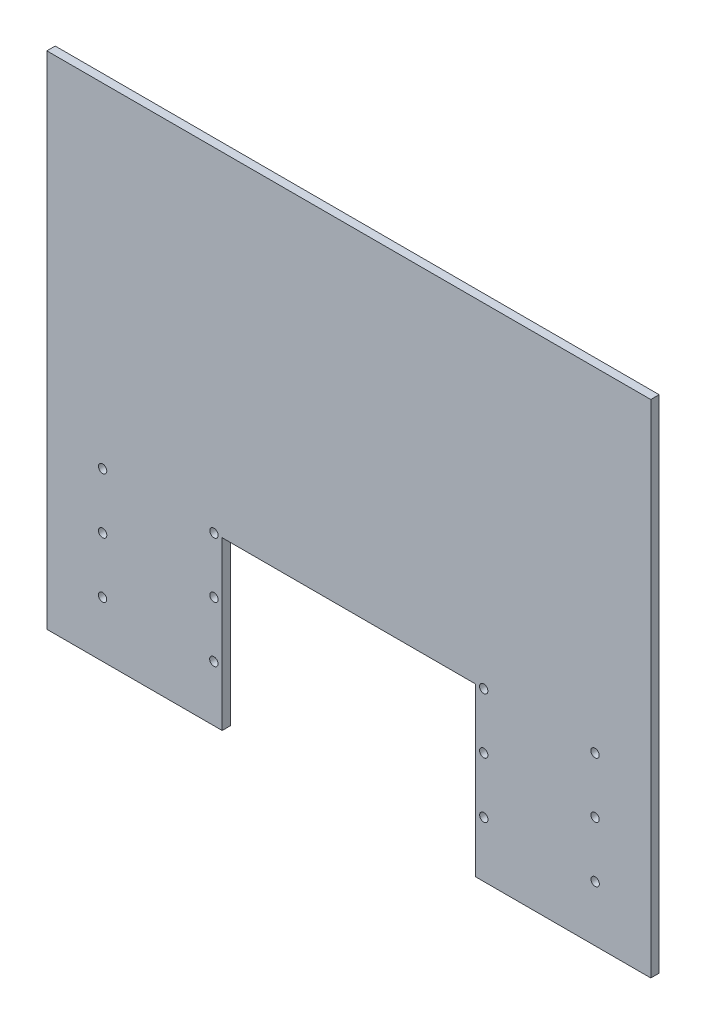
ISO-10303-21;
HEADER;
FILE_DESCRIPTION(('STEP AP214'),'2;1');
FILE_NAME('part.step','',(''),(''),'','','');
FILE_SCHEMA(('AUTOMOTIVE_DESIGN { 1 0 10303 214 1 1 1 1 }'));
ENDSEC;
DATA;
#1=APPLICATION_CONTEXT('core data for automotive mechanical design processes');
#2=APPLICATION_PROTOCOL_DEFINITION('international standard','automotive_design',2000,#1);
#3=PRODUCT_CONTEXT('',#1,'mechanical');
#4=PRODUCT('Part','Part','',(#3));
#5=PRODUCT_RELATED_PRODUCT_CATEGORY('part','',(#4));
#6=PRODUCT_DEFINITION_FORMATION('','',#4);
#7=PRODUCT_DEFINITION_CONTEXT('part definition',#1,'design');
#8=PRODUCT_DEFINITION('design','',#6,#7);
#9=PRODUCT_DEFINITION_SHAPE('','',#8);
#10=(LENGTH_UNIT() NAMED_UNIT(*) SI_UNIT(.MILLI.,.METRE.));
#11=(NAMED_UNIT(*) PLANE_ANGLE_UNIT() SI_UNIT($,.RADIAN.));
#12=(NAMED_UNIT(*) SI_UNIT($,.STERADIAN.) SOLID_ANGLE_UNIT());
#13=UNCERTAINTY_MEASURE_WITH_UNIT(LENGTH_MEASURE(1.E-05),#10,'distance_accuracy_value','');
#14=(GEOMETRIC_REPRESENTATION_CONTEXT(3) GLOBAL_UNCERTAINTY_ASSIGNED_CONTEXT((#13)) GLOBAL_UNIT_ASSIGNED_CONTEXT((#10,
#11,#12)) REPRESENTATION_CONTEXT('',''));
#15=CARTESIAN_POINT('',(0.,0.,0.));
#16=DIRECTION('',(0.,0.,1.));
#17=DIRECTION('',(1.,0.,0.));
#18=AXIS2_PLACEMENT_3D('',#15,#16,#17);
#19=CARTESIAN_POINT('',(0.,-52.4301503937767,1.5));
#20=DIRECTION('',(0.,1.,0.));
#21=DIRECTION('',(-1.,0.,0.));
#22=AXIS2_PLACEMENT_3D('',#19,#20,#21);
#23=PLANE('',#22);
#24=DIRECTION('',(1.,0.,0.));
#25=VECTOR('',#24,1.);
#26=CARTESIAN_POINT('',(0.,-52.4301503937767,0.));
#27=LINE('',#26,#25);
#28=CARTESIAN_POINT('',(-54.4329643296433,-52.4301503937767,0.));
#29=VERTEX_POINT('',#28);
#30=CARTESIAN_POINT('',(-22.9329643296433,-52.4301503937767,0.));
#31=VERTEX_POINT('',#30);
#32=EDGE_CURVE('E166',#29,#31,#27,.T.);
#33=ORIENTED_EDGE('',*,*,#32,.T.);
#34=DIRECTION('',(0.,0.,-1.));
#35=VECTOR('',#34,1.);
#36=CARTESIAN_POINT('',(-22.9329643296433,-52.4301503937767,1.5));
#37=LINE('',#36,#35);
#38=CARTESIAN_POINT('',(-22.9329643296433,-52.4301503937767,1.5));
#39=VERTEX_POINT('',#38);
#40=EDGE_CURVE('E11',#39,#31,#37,.T.);
#41=ORIENTED_EDGE('',*,*,#40,.F.);
#42=DIRECTION('',(1.,0.,0.));
#43=VECTOR('',#42,1.);
#44=CARTESIAN_POINT('',(0.,-52.4301503937767,1.5));
#45=LINE('',#44,#43);
#46=CARTESIAN_POINT('',(-54.4329643296433,-52.4301503937767,1.5));
#47=VERTEX_POINT('',#46);
#48=EDGE_CURVE('E221',#47,#39,#45,.T.);
#49=ORIENTED_EDGE('',*,*,#48,.F.);
#50=DIRECTION('',(0.,0.,-1.));
#51=VECTOR('',#50,1.);
#52=CARTESIAN_POINT('',(-54.4329643296433,-52.4301503937767,1.5));
#53=LINE('',#52,#51);
#54=EDGE_CURVE('E165',#47,#29,#53,.T.);
#55=ORIENTED_EDGE('',*,*,#54,.T.);
#56=EDGE_LOOP('',(#33,#41,#49,#55));
#57=FACE_BOUND('',#56,.T.);
#58=ADVANCED_FACE('F34',(#57),#23,.F.);
#59=CARTESIAN_POINT('',(-22.9329643296433,0.,1.5));
#60=DIRECTION('',(-1.,0.,0.));
#61=DIRECTION('',(0.,0.,1.));
#62=AXIS2_PLACEMENT_3D('',#59,#60,#61);
#63=PLANE('',#62);
#64=DIRECTION('',(0.,1.,0.));
#65=VECTOR('',#64,1.);
#66=CARTESIAN_POINT('',(-22.9329643296433,0.,0.));
#67=LINE('',#66,#65);
#68=CARTESIAN_POINT('',(-22.9329643296433,-22.4301503937767,0.));
#69=VERTEX_POINT('',#68);
#70=EDGE_CURVE('E169',#31,#69,#67,.T.);
#71=ORIENTED_EDGE('',*,*,#70,.T.);
#72=DIRECTION('',(0.,0.,-1.));
#73=VECTOR('',#72,1.);
#74=CARTESIAN_POINT('',(-22.9329643296433,-22.4301503937767,1.5));
#75=LINE('',#74,#73);
#76=CARTESIAN_POINT('',(-22.9329643296433,-22.4301503937767,1.5));
#77=VERTEX_POINT('',#76);
#78=EDGE_CURVE('E42',#77,#69,#75,.T.);
#79=ORIENTED_EDGE('',*,*,#78,.F.);
#80=DIRECTION('',(0.,1.,0.));
#81=VECTOR('',#80,1.);
#82=CARTESIAN_POINT('',(-22.9329643296433,0.,1.5));
#83=LINE('',#82,#81);
#84=EDGE_CURVE('E89',#39,#77,#83,.T.);
#85=ORIENTED_EDGE('',*,*,#84,.F.);
#86=ORIENTED_EDGE('',*,*,#40,.T.);
#87=EDGE_LOOP('',(#71,#79,#85,#86));
#88=FACE_BOUND('',#87,.T.);
#89=ADVANCED_FACE('F234',(#88),#63,.F.);
#90=CARTESIAN_POINT('',(0.,-22.4301503937767,1.5));
#91=DIRECTION('',(0.,-1.,0.));
#92=DIRECTION('',(1.,0.,0.));
#93=AXIS2_PLACEMENT_3D('',#90,#91,#92);
#94=PLANE('',#93);
#95=DIRECTION('',(-1.,0.,0.));
#96=VECTOR('',#95,1.);
#97=CARTESIAN_POINT('',(0.,-22.4301503937767,0.));
#98=LINE('',#97,#96);
#99=CARTESIAN_POINT('',(22.5670356703567,-22.4301503937767,0.));
#100=VERTEX_POINT('',#99);
#101=EDGE_CURVE('E172',#100,#69,#98,.T.);
#102=ORIENTED_EDGE('',*,*,#101,.F.);
#103=DIRECTION('',(0.,0.,-1.));
#104=VECTOR('',#103,1.);
#105=CARTESIAN_POINT('',(22.5670356703567,-22.4301503937767,1.5));
#106=LINE('',#105,#104);
#107=CARTESIAN_POINT('',(22.5670356703567,-22.4301503937767,1.5));
#108=VERTEX_POINT('',#107);
#109=EDGE_CURVE('E227',#108,#100,#106,.T.);
#110=ORIENTED_EDGE('',*,*,#109,.F.);
#111=DIRECTION('',(-1.,0.,0.));
#112=VECTOR('',#111,1.);
#113=CARTESIAN_POINT('',(0.,-22.4301503937767,1.5));
#114=LINE('',#113,#112);
#115=EDGE_CURVE('E233',#108,#77,#114,.T.);
#116=ORIENTED_EDGE('',*,*,#115,.T.);
#117=ORIENTED_EDGE('',*,*,#78,.T.);
#118=EDGE_LOOP('',(#102,#110,#116,#117));
#119=FACE_BOUND('',#118,.T.);
#120=ADVANCED_FACE('F231',(#119),#94,.T.);
#121=CARTESIAN_POINT('',(22.5670356703567,0.,1.5));
#122=DIRECTION('',(-1.,0.,0.));
#123=DIRECTION('',(0.,-1.,0.));
#124=AXIS2_PLACEMENT_3D('',#121,#122,#123);
#125=PLANE('',#124);
#126=DIRECTION('',(0.,1.,0.));
#127=VECTOR('',#126,1.);
#128=CARTESIAN_POINT('',(22.5670356703567,0.,0.));
#129=LINE('',#128,#127);
#130=CARTESIAN_POINT('',(22.5670356703567,-52.4301503937767,0.));
#131=VERTEX_POINT('',#130);
#132=EDGE_CURVE('E175',#131,#100,#129,.T.);
#133=ORIENTED_EDGE('',*,*,#132,.F.);
#134=DIRECTION('',(0.,0.,-1.));
#135=VECTOR('',#134,1.);
#136=CARTESIAN_POINT('',(22.5670356703567,-52.4301503937767,1.5));
#137=LINE('',#136,#135);
#138=CARTESIAN_POINT('',(22.5670356703567,-52.4301503937767,1.5));
#139=VERTEX_POINT('',#138);
#140=EDGE_CURVE('E225',#139,#131,#137,.T.);
#141=ORIENTED_EDGE('',*,*,#140,.F.);
#142=DIRECTION('',(0.,1.,0.));
#143=VECTOR('',#142,1.);
#144=CARTESIAN_POINT('',(22.5670356703567,0.,1.5));
#145=LINE('',#144,#143);
#146=EDGE_CURVE('E245',#139,#108,#145,.T.);
#147=ORIENTED_EDGE('',*,*,#146,.T.);
#148=ORIENTED_EDGE('',*,*,#109,.T.);
#149=EDGE_LOOP('',(#133,#141,#147,#148));
#150=FACE_BOUND('',#149,.T.);
#151=ADVANCED_FACE('F243',(#150),#125,.T.);
#152=CARTESIAN_POINT('',(0.,-52.4301503937767,1.5));
#153=DIRECTION('',(0.,-1.,0.));
#154=DIRECTION('',(1.,0.,0.));
#155=AXIS2_PLACEMENT_3D('',#152,#153,#154);
#156=PLANE('',#155);
#157=DIRECTION('',(-1.,0.,0.));
#158=VECTOR('',#157,1.);
#159=CARTESIAN_POINT('',(0.,-52.4301503937767,0.));
#160=LINE('',#159,#158);
#161=CARTESIAN_POINT('',(54.0670356703567,-52.4301503937767,0.));
#162=VERTEX_POINT('',#161);
#163=EDGE_CURVE('E178',#162,#131,#160,.T.);
#164=ORIENTED_EDGE('',*,*,#163,.F.);
#165=DIRECTION('',(0.,0.,-1.));
#166=VECTOR('',#165,1.);
#167=CARTESIAN_POINT('',(54.0670356703567,-52.4301503937767,1.5));
#168=LINE('',#167,#166);
#169=CARTESIAN_POINT('',(54.0670356703567,-52.4301503937767,1.5));
#170=VERTEX_POINT('',#169);
#171=EDGE_CURVE('E114',#170,#162,#168,.T.);
#172=ORIENTED_EDGE('',*,*,#171,.F.);
#173=DIRECTION('',(-1.,0.,0.));
#174=VECTOR('',#173,1.);
#175=CARTESIAN_POINT('',(0.,-52.4301503937767,1.5));
#176=LINE('',#175,#174);
#177=EDGE_CURVE('E122',#170,#139,#176,.T.);
#178=ORIENTED_EDGE('',*,*,#177,.T.);
#179=ORIENTED_EDGE('',*,*,#140,.T.);
#180=EDGE_LOOP('',(#164,#172,#178,#179));
#181=FACE_BOUND('',#180,.T.);
#182=ADVANCED_FACE('F251',(#181),#156,.T.);
#183=CARTESIAN_POINT('',(54.0670356703567,0.,1.5));
#184=DIRECTION('',(1.,0.,0.));
#185=DIRECTION('',(0.,1.,0.));
#186=AXIS2_PLACEMENT_3D('',#183,#184,#185);
#187=PLANE('',#186);
#188=DIRECTION('',(0.,-1.,0.));
#189=VECTOR('',#188,1.);
#190=CARTESIAN_POINT('',(54.0670356703567,0.,0.));
#191=LINE('',#190,#189);
#192=CARTESIAN_POINT('',(54.0670356703567,37.5698496062233,0.));
#193=VERTEX_POINT('',#192);
#194=EDGE_CURVE('E109',#193,#162,#191,.T.);
#195=ORIENTED_EDGE('',*,*,#194,.F.);
#196=DIRECTION('',(0.,0.,-1.));
#197=VECTOR('',#196,1.);
#198=CARTESIAN_POINT('',(54.0670356703567,37.5698496062233,1.5));
#199=LINE('',#198,#197);
#200=CARTESIAN_POINT('',(54.0670356703567,37.5698496062233,1.5));
#201=VERTEX_POINT('',#200);
#202=EDGE_CURVE('E104',#201,#193,#199,.T.);
#203=ORIENTED_EDGE('',*,*,#202,.F.);
#204=DIRECTION('',(0.,-1.,0.));
#205=VECTOR('',#204,1.);
#206=CARTESIAN_POINT('',(54.0670356703567,0.,1.5));
#207=LINE('',#206,#205);
#208=EDGE_CURVE('E107',#201,#170,#207,.T.);
#209=ORIENTED_EDGE('',*,*,#208,.T.);
#210=ORIENTED_EDGE('',*,*,#171,.T.);
#211=EDGE_LOOP('',(#195,#203,#209,#210));
#212=FACE_BOUND('',#211,.T.);
#213=ADVANCED_FACE('F106',(#212),#187,.T.);
#214=CARTESIAN_POINT('',(0.,37.5698496062233,1.5));
#215=DIRECTION('',(0.,1.,0.));
#216=DIRECTION('',(-1.,0.,0.));
#217=AXIS2_PLACEMENT_3D('',#214,#215,#216);
#218=PLANE('',#217);
#219=DIRECTION('',(1.,0.,0.));
#220=VECTOR('',#219,1.);
#221=CARTESIAN_POINT('',(0.,37.5698496062233,0.));
#222=LINE('',#221,#220);
#223=CARTESIAN_POINT('',(-54.4329643296433,37.5698496062233,0.));
#224=VERTEX_POINT('',#223);
#225=EDGE_CURVE('E182',#224,#193,#222,.T.);
#226=ORIENTED_EDGE('',*,*,#225,.F.);
#227=DIRECTION('',(0.,0.,-1.));
#228=VECTOR('',#227,1.);
#229=CARTESIAN_POINT('',(-54.4329643296433,37.5698496062233,1.5));
#230=LINE('',#229,#228);
#231=CARTESIAN_POINT('',(-54.4329643296433,37.5698496062233,1.5));
#232=VERTEX_POINT('',#231);
#233=EDGE_CURVE('E78',#232,#224,#230,.T.);
#234=ORIENTED_EDGE('',*,*,#233,.F.);
#235=DIRECTION('',(1.,0.,0.));
#236=VECTOR('',#235,1.);
#237=CARTESIAN_POINT('',(0.,37.5698496062233,1.5));
#238=LINE('',#237,#236);
#239=EDGE_CURVE('E119',#232,#201,#238,.T.);
#240=ORIENTED_EDGE('',*,*,#239,.T.);
#241=ORIENTED_EDGE('',*,*,#202,.T.);
#242=EDGE_LOOP('',(#226,#234,#240,#241));
#243=FACE_BOUND('',#242,.T.);
#244=ADVANCED_FACE('F124',(#243),#218,.T.);
#245=CARTESIAN_POINT('',(24.0473395892237,-32.4301503937767,1.5));
#246=DIRECTION('',(0.,0.,-1.));
#247=DIRECTION('',(-1.,0.,0.));
#248=AXIS2_PLACEMENT_3D('',#245,#246,#247);
#249=CYLINDRICAL_SURFACE('',#248,0.750000000000002);
#250=CARTESIAN_POINT('',(24.0473395892237,-32.4301503937767,1.5));
#251=DIRECTION('',(0.,0.,1.));
#252=DIRECTION('',(1.,0.,0.));
#253=AXIS2_PLACEMENT_3D('',#250,#251,#252);
#254=CIRCLE('',#253,0.750000000000002);
#255=CARTESIAN_POINT('',(24.7973395892237,-32.4301503937767,1.5));
#256=VERTEX_POINT('',#255);
#257=EDGE_CURVE('E159',#256,#256,#254,.F.);
#258=ORIENTED_EDGE('',*,*,#257,.F.);
#259=EDGE_LOOP('',(#258));
#260=FACE_BOUND('',#259,.T.);
#261=CARTESIAN_POINT('',(24.0473395892237,-32.4301503937767,0.));
#262=DIRECTION('',(0.,0.,1.));
#263=DIRECTION('',(1.,0.,0.));
#264=AXIS2_PLACEMENT_3D('',#261,#262,#263);
#265=CIRCLE('',#264,0.750000000000002);
#266=CARTESIAN_POINT('',(24.7973395892237,-32.4301503937767,0.));
#267=VERTEX_POINT('',#266);
#268=EDGE_CURVE('E215',#267,#267,#265,.F.);
#269=ORIENTED_EDGE('',*,*,#268,.T.);
#270=EDGE_LOOP('',(#269));
#271=FACE_BOUND('',#270,.T.);
#272=ADVANCED_FACE('F284',(#260,#271),#249,.F.);
#273=CARTESIAN_POINT('',(44.0670356703567,-42.4301503937767,1.5));
#274=DIRECTION('',(0.,0.,-1.));
#275=DIRECTION('',(-1.,0.,0.));
#276=AXIS2_PLACEMENT_3D('',#273,#274,#275);
#277=CYLINDRICAL_SURFACE('',#276,0.749999999999999);
#278=CARTESIAN_POINT('',(44.0670356703567,-42.4301503937767,1.5));
#279=DIRECTION('',(0.,0.,1.));
#280=DIRECTION('',(1.,0.,0.));
#281=AXIS2_PLACEMENT_3D('',#278,#279,#280);
#282=CIRCLE('',#281,0.749999999999999);
#283=CARTESIAN_POINT('',(44.8170356703567,-42.4301503937767,1.5));
#284=VERTEX_POINT('',#283);
#285=EDGE_CURVE('E156',#284,#284,#282,.F.);
#286=ORIENTED_EDGE('',*,*,#285,.F.);
#287=EDGE_LOOP('',(#286));
#288=FACE_BOUND('',#287,.T.);
#289=CARTESIAN_POINT('',(44.0670356703567,-42.4301503937767,0.));
#290=DIRECTION('',(0.,0.,1.));
#291=DIRECTION('',(1.,0.,0.));
#292=AXIS2_PLACEMENT_3D('',#289,#290,#291);
#293=CIRCLE('',#292,0.749999999999999);
#294=CARTESIAN_POINT('',(44.8170356703567,-42.4301503937767,0.));
#295=VERTEX_POINT('',#294);
#296=EDGE_CURVE('E212',#295,#295,#293,.F.);
#297=ORIENTED_EDGE('',*,*,#296,.T.);
#298=EDGE_LOOP('',(#297));
#299=FACE_BOUND('',#298,.T.);
#300=ADVANCED_FACE('F288',(#288,#299),#277,.F.);
#301=CARTESIAN_POINT('',(24.0670356703567,-42.4301503937767,1.5));
#302=DIRECTION('',(0.,0.,-1.));
#303=DIRECTION('',(-1.,0.,0.));
#304=AXIS2_PLACEMENT_3D('',#301,#302,#303);
#305=CYLINDRICAL_SURFACE('',#304,0.749999999999999);
#306=CARTESIAN_POINT('',(24.0670356703567,-42.4301503937767,1.5));
#307=DIRECTION('',(0.,0.,1.));
#308=DIRECTION('',(1.,0.,0.));
#309=AXIS2_PLACEMENT_3D('',#306,#307,#308);
#310=CIRCLE('',#309,0.749999999999999);
#311=CARTESIAN_POINT('',(24.8170356703567,-42.4301503937767,1.5));
#312=VERTEX_POINT('',#311);
#313=EDGE_CURVE('E153',#312,#312,#310,.F.);
#314=ORIENTED_EDGE('',*,*,#313,.F.);
#315=EDGE_LOOP('',(#314));
#316=FACE_BOUND('',#315,.T.);
#317=CARTESIAN_POINT('',(24.0670356703567,-42.4301503937767,0.));
#318=DIRECTION('',(0.,0.,1.));
#319=DIRECTION('',(1.,0.,0.));
#320=AXIS2_PLACEMENT_3D('',#317,#318,#319);
#321=CIRCLE('',#320,0.749999999999999);
#322=CARTESIAN_POINT('',(24.8170356703567,-42.4301503937767,0.));
#323=VERTEX_POINT('',#322);
#324=EDGE_CURVE('E209',#323,#323,#321,.F.);
#325=ORIENTED_EDGE('',*,*,#324,.T.);
#326=EDGE_LOOP('',(#325));
#327=FACE_BOUND('',#326,.T.);
#328=ADVANCED_FACE('F294',(#316,#327),#305,.F.);
#329=CARTESIAN_POINT('',(44.0473395892237,-32.4301503937767,1.5));
#330=DIRECTION('',(0.,0.,-1.));
#331=DIRECTION('',(-1.,0.,0.));
#332=AXIS2_PLACEMENT_3D('',#329,#330,#331);
#333=CYLINDRICAL_SURFACE('',#332,0.749999999999999);
#334=CARTESIAN_POINT('',(44.0473395892237,-32.4301503937767,1.5));
#335=DIRECTION('',(0.,0.,1.));
#336=DIRECTION('',(1.,0.,0.));
#337=AXIS2_PLACEMENT_3D('',#334,#335,#336);
#338=CIRCLE('',#337,0.749999999999999);
#339=CARTESIAN_POINT('',(44.7973395892237,-32.4301503937767,1.5));
#340=VERTEX_POINT('',#339);
#341=EDGE_CURVE('E150',#340,#340,#338,.F.);
#342=ORIENTED_EDGE('',*,*,#341,.F.);
#343=EDGE_LOOP('',(#342));
#344=FACE_BOUND('',#343,.T.);
#345=CARTESIAN_POINT('',(44.0473395892237,-32.4301503937767,0.));
#346=DIRECTION('',(0.,0.,1.));
#347=DIRECTION('',(1.,0.,0.));
#348=AXIS2_PLACEMENT_3D('',#345,#346,#347);
#349=CIRCLE('',#348,0.749999999999999);
#350=CARTESIAN_POINT('',(44.7973395892237,-32.4301503937767,0.));
#351=VERTEX_POINT('',#350);
#352=EDGE_CURVE('E206',#351,#351,#349,.F.);
#353=ORIENTED_EDGE('',*,*,#352,.T.);
#354=EDGE_LOOP('',(#353));
#355=FACE_BOUND('',#354,.T.);
#356=ADVANCED_FACE('F303',(#344,#355),#333,.F.);
#357=CARTESIAN_POINT('',(24.0473395892237,-22.4301503937767,1.5));
#358=DIRECTION('',(0.,0.,-1.));
#359=DIRECTION('',(-1.,0.,0.));
#360=AXIS2_PLACEMENT_3D('',#357,#358,#359);
#361=CYLINDRICAL_SURFACE('',#360,0.750000000000002);
#362=CARTESIAN_POINT('',(24.0473395892237,-22.4301503937767,1.5));
#363=DIRECTION('',(0.,0.,1.));
#364=DIRECTION('',(1.,0.,0.));
#365=AXIS2_PLACEMENT_3D('',#362,#363,#364);
#366=CIRCLE('',#365,0.750000000000002);
#367=CARTESIAN_POINT('',(24.7973395892237,-22.4301503937767,1.5));
#368=VERTEX_POINT('',#367);
#369=EDGE_CURVE('E147',#368,#368,#366,.F.);
#370=ORIENTED_EDGE('',*,*,#369,.F.);
#371=EDGE_LOOP('',(#370));
#372=FACE_BOUND('',#371,.T.);
#373=CARTESIAN_POINT('',(24.0473395892237,-22.4301503937767,0.));
#374=DIRECTION('',(0.,0.,1.));
#375=DIRECTION('',(1.,0.,0.));
#376=AXIS2_PLACEMENT_3D('',#373,#374,#375);
#377=CIRCLE('',#376,0.750000000000002);
#378=CARTESIAN_POINT('',(24.7973395892237,-22.4301503937767,0.));
#379=VERTEX_POINT('',#378);
#380=EDGE_CURVE('E203',#379,#379,#377,.F.);
#381=ORIENTED_EDGE('',*,*,#380,.T.);
#382=EDGE_LOOP('',(#381));
#383=FACE_BOUND('',#382,.T.);
#384=ADVANCED_FACE('F307',(#372,#383),#361,.F.);
#385=CARTESIAN_POINT('',(-44.4132682485103,-22.4301503937767,1.5));
#386=DIRECTION('',(0.,0.,-1.));
#387=DIRECTION('',(-1.,0.,0.));
#388=AXIS2_PLACEMENT_3D('',#385,#386,#387);
#389=CYLINDRICAL_SURFACE('',#388,0.749999999999999);
#390=CARTESIAN_POINT('',(-44.4132682485103,-22.4301503937767,1.5));
#391=DIRECTION('',(0.,0.,1.));
#392=DIRECTION('',(1.,0.,0.));
#393=AXIS2_PLACEMENT_3D('',#390,#391,#392);
#394=CIRCLE('',#393,0.749999999999999);
#395=CARTESIAN_POINT('',(-43.6632682485103,-22.4301503937767,1.5));
#396=VERTEX_POINT('',#395);
#397=EDGE_CURVE('E144',#396,#396,#394,.T.);
#398=ORIENTED_EDGE('',*,*,#397,.T.);
#399=EDGE_LOOP('',(#398));
#400=FACE_BOUND('',#399,.T.);
#401=CARTESIAN_POINT('',(-44.4132682485103,-22.4301503937767,0.));
#402=DIRECTION('',(0.,0.,1.));
#403=DIRECTION('',(1.,0.,0.));
#404=AXIS2_PLACEMENT_3D('',#401,#402,#403);
#405=CIRCLE('',#404,0.749999999999999);
#406=CARTESIAN_POINT('',(-43.6632682485103,-22.4301503937767,0.));
#407=VERTEX_POINT('',#406);
#408=EDGE_CURVE('E200',#407,#407,#405,.T.);
#409=ORIENTED_EDGE('',*,*,#408,.F.);
#410=EDGE_LOOP('',(#409));
#411=FACE_BOUND('',#410,.T.);
#412=ADVANCED_FACE('F311',(#400,#411),#389,.F.);
#413=CARTESIAN_POINT('',(-24.4132682485103,-22.4301503937767,1.5));
#414=DIRECTION('',(0.,0.,-1.));
#415=DIRECTION('',(-1.,0.,0.));
#416=AXIS2_PLACEMENT_3D('',#413,#414,#415);
#417=CYLINDRICAL_SURFACE('',#416,0.750000000000002);
#418=CARTESIAN_POINT('',(-24.4132682485103,-22.4301503937767,1.5));
#419=DIRECTION('',(0.,0.,1.));
#420=DIRECTION('',(1.,0.,0.));
#421=AXIS2_PLACEMENT_3D('',#418,#419,#420);
#422=CIRCLE('',#421,0.750000000000002);
#423=CARTESIAN_POINT('',(-23.6632682485103,-22.4301503937767,1.5));
#424=VERTEX_POINT('',#423);
#425=EDGE_CURVE('E141',#424,#424,#422,.T.);
#426=ORIENTED_EDGE('',*,*,#425,.T.);
#427=EDGE_LOOP('',(#426));
#428=FACE_BOUND('',#427,.T.);
#429=CARTESIAN_POINT('',(-24.4132682485103,-22.4301503937767,0.));
#430=DIRECTION('',(0.,0.,1.));
#431=DIRECTION('',(1.,0.,0.));
#432=AXIS2_PLACEMENT_3D('',#429,#430,#431);
#433=CIRCLE('',#432,0.750000000000002);
#434=CARTESIAN_POINT('',(-23.6632682485103,-22.4301503937767,0.));
#435=VERTEX_POINT('',#434);
#436=EDGE_CURVE('E197',#435,#435,#433,.T.);
#437=ORIENTED_EDGE('',*,*,#436,.F.);
#438=EDGE_LOOP('',(#437));
#439=FACE_BOUND('',#438,.T.);
#440=ADVANCED_FACE('F315',(#428,#439),#417,.F.);
#441=CARTESIAN_POINT('',(-24.4329643296433,-42.4301503937767,1.5));
#442=DIRECTION('',(0.,0.,-1.));
#443=DIRECTION('',(-1.,0.,0.));
#444=AXIS2_PLACEMENT_3D('',#441,#442,#443);
#445=CYLINDRICAL_SURFACE('',#444,0.750000000000002);
#446=CARTESIAN_POINT('',(-24.4329643296433,-42.4301503937767,1.5));
#447=DIRECTION('',(0.,0.,1.));
#448=DIRECTION('',(1.,0.,0.));
#449=AXIS2_PLACEMENT_3D('',#446,#447,#448);
#450=CIRCLE('',#449,0.750000000000002);
#451=CARTESIAN_POINT('',(-23.6829643296433,-42.4301503937767,1.5));
#452=VERTEX_POINT('',#451);
#453=EDGE_CURVE('E138',#452,#452,#450,.T.);
#454=ORIENTED_EDGE('',*,*,#453,.T.);
#455=EDGE_LOOP('',(#454));
#456=FACE_BOUND('',#455,.T.);
#457=CARTESIAN_POINT('',(-24.4329643296433,-42.4301503937767,0.));
#458=DIRECTION('',(0.,0.,1.));
#459=DIRECTION('',(1.,0.,0.));
#460=AXIS2_PLACEMENT_3D('',#457,#458,#459);
#461=CIRCLE('',#460,0.750000000000002);
#462=CARTESIAN_POINT('',(-23.6829643296433,-42.4301503937767,0.));
#463=VERTEX_POINT('',#462);
#464=EDGE_CURVE('E194',#463,#463,#461,.T.);
#465=ORIENTED_EDGE('',*,*,#464,.F.);
#466=EDGE_LOOP('',(#465));
#467=FACE_BOUND('',#466,.T.);
#468=ADVANCED_FACE('F319',(#456,#467),#445,.F.);
#469=CARTESIAN_POINT('',(-24.4132682485103,-32.4301503937767,1.5));
#470=DIRECTION('',(0.,0.,-1.));
#471=DIRECTION('',(-1.,0.,0.));
#472=AXIS2_PLACEMENT_3D('',#469,#470,#471);
#473=CYLINDRICAL_SURFACE('',#472,0.750000000000002);
#474=CARTESIAN_POINT('',(-24.4132682485103,-32.4301503937767,1.5));
#475=DIRECTION('',(0.,0.,1.));
#476=DIRECTION('',(1.,0.,0.));
#477=AXIS2_PLACEMENT_3D('',#474,#475,#476);
#478=CIRCLE('',#477,0.750000000000002);
#479=CARTESIAN_POINT('',(-23.6632682485103,-32.4301503937767,1.5));
#480=VERTEX_POINT('',#479);
#481=EDGE_CURVE('E135',#480,#480,#478,.T.);
#482=ORIENTED_EDGE('',*,*,#481,.T.);
#483=EDGE_LOOP('',(#482));
#484=FACE_BOUND('',#483,.T.);
#485=CARTESIAN_POINT('',(-24.4132682485103,-32.4301503937767,0.));
#486=DIRECTION('',(0.,0.,1.));
#487=DIRECTION('',(1.,0.,0.));
#488=AXIS2_PLACEMENT_3D('',#485,#486,#487);
#489=CIRCLE('',#488,0.750000000000002);
#490=CARTESIAN_POINT('',(-23.6632682485103,-32.4301503937767,0.));
#491=VERTEX_POINT('',#490);
#492=EDGE_CURVE('E191',#491,#491,#489,.T.);
#493=ORIENTED_EDGE('',*,*,#492,.F.);
#494=EDGE_LOOP('',(#493));
#495=FACE_BOUND('',#494,.T.);
#496=ADVANCED_FACE('F323',(#484,#495),#473,.F.);
#497=CARTESIAN_POINT('',(-44.4132682485103,-32.4301503937767,1.5));
#498=DIRECTION('',(0.,0.,-1.));
#499=DIRECTION('',(-1.,0.,0.));
#500=AXIS2_PLACEMENT_3D('',#497,#498,#499);
#501=CYLINDRICAL_SURFACE('',#500,0.749999999999999);
#502=CARTESIAN_POINT('',(-44.4132682485103,-32.4301503937767,1.5));
#503=DIRECTION('',(0.,0.,1.));
#504=DIRECTION('',(1.,0.,0.));
#505=AXIS2_PLACEMENT_3D('',#502,#503,#504);
#506=CIRCLE('',#505,0.749999999999999);
#507=CARTESIAN_POINT('',(-43.6632682485103,-32.4301503937767,1.5));
#508=VERTEX_POINT('',#507);
#509=EDGE_CURVE('E132',#508,#508,#506,.T.);
#510=ORIENTED_EDGE('',*,*,#509,.T.);
#511=EDGE_LOOP('',(#510));
#512=FACE_BOUND('',#511,.T.);
#513=CARTESIAN_POINT('',(-44.4132682485103,-32.4301503937767,0.));
#514=DIRECTION('',(0.,0.,1.));
#515=DIRECTION('',(1.,0.,0.));
#516=AXIS2_PLACEMENT_3D('',#513,#514,#515);
#517=CIRCLE('',#516,0.749999999999999);
#518=CARTESIAN_POINT('',(-43.6632682485103,-32.4301503937767,0.));
#519=VERTEX_POINT('',#518);
#520=EDGE_CURVE('E188',#519,#519,#517,.T.);
#521=ORIENTED_EDGE('',*,*,#520,.F.);
#522=EDGE_LOOP('',(#521));
#523=FACE_BOUND('',#522,.T.);
#524=ADVANCED_FACE('F265',(#512,#523),#501,.F.);
#525=CARTESIAN_POINT('',(-44.4329643296433,-42.4301503937767,1.5));
#526=DIRECTION('',(0.,0.,-1.));
#527=DIRECTION('',(-1.,0.,0.));
#528=AXIS2_PLACEMENT_3D('',#525,#526,#527);
#529=CYLINDRICAL_SURFACE('',#528,0.749999999999999);
#530=CARTESIAN_POINT('',(-44.4329643296433,-42.4301503937767,1.5));
#531=DIRECTION('',(0.,0.,1.));
#532=DIRECTION('',(1.,0.,0.));
#533=AXIS2_PLACEMENT_3D('',#530,#531,#532);
#534=CIRCLE('',#533,0.749999999999999);
#535=CARTESIAN_POINT('',(-43.6829643296433,-42.4301503937767,1.5));
#536=VERTEX_POINT('',#535);
#537=EDGE_CURVE('E126',#536,#536,#534,.T.);
#538=ORIENTED_EDGE('',*,*,#537,.T.);
#539=EDGE_LOOP('',(#538));
#540=FACE_BOUND('',#539,.T.);
#541=CARTESIAN_POINT('',(-44.4329643296433,-42.4301503937767,0.));
#542=DIRECTION('',(0.,0.,1.));
#543=DIRECTION('',(1.,0.,0.));
#544=AXIS2_PLACEMENT_3D('',#541,#542,#543);
#545=CIRCLE('',#544,0.749999999999999);
#546=CARTESIAN_POINT('',(-43.6829643296433,-42.4301503937767,0.));
#547=VERTEX_POINT('',#546);
#548=EDGE_CURVE('E185',#547,#547,#545,.T.);
#549=ORIENTED_EDGE('',*,*,#548,.F.);
#550=EDGE_LOOP('',(#549));
#551=FACE_BOUND('',#550,.T.);
#552=ADVANCED_FACE('F257',(#540,#551),#529,.F.);
#553=CARTESIAN_POINT('',(-54.4329643296433,0.,1.5));
#554=DIRECTION('',(1.,0.,0.));
#555=DIRECTION('',(0.,1.,0.));
#556=AXIS2_PLACEMENT_3D('',#553,#554,#555);
#557=PLANE('',#556);
#558=DIRECTION('',(0.,-1.,0.));
#559=VECTOR('',#558,1.);
#560=CARTESIAN_POINT('',(-54.4329643296433,0.,0.));
#561=LINE('',#560,#559);
#562=EDGE_CURVE('E81',#224,#29,#561,.T.);
#563=ORIENTED_EDGE('',*,*,#562,.T.);
#564=ORIENTED_EDGE('',*,*,#54,.F.);
#565=DIRECTION('',(0.,-1.,0.));
#566=VECTOR('',#565,1.);
#567=CARTESIAN_POINT('',(-54.4329643296433,0.,1.5));
#568=LINE('',#567,#566);
#569=EDGE_CURVE('E50',#232,#47,#568,.T.);
#570=ORIENTED_EDGE('',*,*,#569,.F.);
#571=ORIENTED_EDGE('',*,*,#233,.T.);
#572=EDGE_LOOP('',(#563,#564,#570,#571));
#573=FACE_BOUND('',#572,.T.);
#574=ADVANCED_FACE('F254',(#573),#557,.F.);
#575=CARTESIAN_POINT('',(44.0473395892237,-22.4301503937767,1.5));
#576=DIRECTION('',(0.,0.,-1.));
#577=DIRECTION('',(-1.,0.,0.));
#578=AXIS2_PLACEMENT_3D('',#575,#576,#577);
#579=CYLINDRICAL_SURFACE('',#578,0.749999999999999);
#580=CARTESIAN_POINT('',(44.0473395892237,-22.4301503937767,1.5));
#581=DIRECTION('',(0.,0.,1.));
#582=DIRECTION('',(1.,0.,0.));
#583=AXIS2_PLACEMENT_3D('',#580,#581,#582);
#584=CIRCLE('',#583,0.749999999999999);
#585=CARTESIAN_POINT('',(44.7973395892237,-22.4301503937767,1.5));
#586=VERTEX_POINT('',#585);
#587=EDGE_CURVE('E162',#586,#586,#584,.F.);
#588=ORIENTED_EDGE('',*,*,#587,.F.);
#589=EDGE_LOOP('',(#588));
#590=FACE_BOUND('',#589,.T.);
#591=CARTESIAN_POINT('',(44.0473395892237,-22.4301503937767,0.));
#592=DIRECTION('',(0.,0.,1.));
#593=DIRECTION('',(1.,0.,0.));
#594=AXIS2_PLACEMENT_3D('',#591,#592,#593);
#595=CIRCLE('',#594,0.749999999999999);
#596=CARTESIAN_POINT('',(44.7973395892237,-22.4301503937767,0.));
#597=VERTEX_POINT('',#596);
#598=EDGE_CURVE('E218',#597,#597,#595,.F.);
#599=ORIENTED_EDGE('',*,*,#598,.T.);
#600=EDGE_LOOP('',(#599));
#601=FACE_BOUND('',#600,.T.);
#602=ADVANCED_FACE('F256',(#590,#601),#579,.F.);
#603=CARTESIAN_POINT('',(0.,0.,1.5));
#604=DIRECTION('',(0.,0.,1.));
#605=DIRECTION('',(1.,0.,0.));
#606=AXIS2_PLACEMENT_3D('',#603,#604,#605);
#607=PLANE('',#606);
#608=ORIENTED_EDGE('',*,*,#48,.T.);
#609=ORIENTED_EDGE('',*,*,#84,.T.);
#610=ORIENTED_EDGE('',*,*,#115,.F.);
#611=ORIENTED_EDGE('',*,*,#146,.F.);
#612=ORIENTED_EDGE('',*,*,#177,.F.);
#613=ORIENTED_EDGE('',*,*,#208,.F.);
#614=ORIENTED_EDGE('',*,*,#239,.F.);
#615=ORIENTED_EDGE('',*,*,#569,.T.);
#616=EDGE_LOOP('',(#608,#609,#610,#611,#612,#613,#614,#615));
#617=FACE_BOUND('',#616,.T.);
#618=ORIENTED_EDGE('',*,*,#537,.F.);
#619=EDGE_LOOP('',(#618));
#620=FACE_BOUND('',#619,.T.);
#621=ORIENTED_EDGE('',*,*,#509,.F.);
#622=EDGE_LOOP('',(#621));
#623=FACE_BOUND('',#622,.T.);
#624=ORIENTED_EDGE('',*,*,#481,.F.);
#625=EDGE_LOOP('',(#624));
#626=FACE_BOUND('',#625,.T.);
#627=ORIENTED_EDGE('',*,*,#453,.F.);
#628=EDGE_LOOP('',(#627));
#629=FACE_BOUND('',#628,.T.);
#630=ORIENTED_EDGE('',*,*,#425,.F.);
#631=EDGE_LOOP('',(#630));
#632=FACE_BOUND('',#631,.T.);
#633=ORIENTED_EDGE('',*,*,#397,.F.);
#634=EDGE_LOOP('',(#633));
#635=FACE_BOUND('',#634,.T.);
#636=ORIENTED_EDGE('',*,*,#369,.T.);
#637=EDGE_LOOP('',(#636));
#638=FACE_BOUND('',#637,.T.);
#639=ORIENTED_EDGE('',*,*,#341,.T.);
#640=EDGE_LOOP('',(#639));
#641=FACE_BOUND('',#640,.T.);
#642=ORIENTED_EDGE('',*,*,#313,.T.);
#643=EDGE_LOOP('',(#642));
#644=FACE_BOUND('',#643,.T.);
#645=ORIENTED_EDGE('',*,*,#285,.T.);
#646=EDGE_LOOP('',(#645));
#647=FACE_BOUND('',#646,.T.);
#648=ORIENTED_EDGE('',*,*,#257,.T.);
#649=EDGE_LOOP('',(#648));
#650=FACE_BOUND('',#649,.T.);
#651=ORIENTED_EDGE('',*,*,#587,.T.);
#652=EDGE_LOOP('',(#651));
#653=FACE_BOUND('',#652,.T.);
#654=ADVANCED_FACE('F117',(#617,#620,#623,#626,#629,#632,#635,#638,#641,#644,#647,#650,#653),
#607,.T.);
#655=CARTESIAN_POINT('',(0.,0.,0.));
#656=DIRECTION('',(0.,0.,1.));
#657=DIRECTION('',(1.,0.,0.));
#658=AXIS2_PLACEMENT_3D('',#655,#656,#657);
#659=PLANE('',#658);
#660=ORIENTED_EDGE('',*,*,#32,.F.);
#661=ORIENTED_EDGE('',*,*,#562,.F.);
#662=ORIENTED_EDGE('',*,*,#225,.T.);
#663=ORIENTED_EDGE('',*,*,#194,.T.);
#664=ORIENTED_EDGE('',*,*,#163,.T.);
#665=ORIENTED_EDGE('',*,*,#132,.T.);
#666=ORIENTED_EDGE('',*,*,#101,.T.);
#667=ORIENTED_EDGE('',*,*,#70,.F.);
#668=EDGE_LOOP('',(#660,#661,#662,#663,#664,#665,#666,#667));
#669=FACE_BOUND('',#668,.T.);
#670=ORIENTED_EDGE('',*,*,#548,.T.);
#671=EDGE_LOOP('',(#670));
#672=FACE_BOUND('',#671,.T.);
#673=ORIENTED_EDGE('',*,*,#520,.T.);
#674=EDGE_LOOP('',(#673));
#675=FACE_BOUND('',#674,.T.);
#676=ORIENTED_EDGE('',*,*,#492,.T.);
#677=EDGE_LOOP('',(#676));
#678=FACE_BOUND('',#677,.T.);
#679=ORIENTED_EDGE('',*,*,#464,.T.);
#680=EDGE_LOOP('',(#679));
#681=FACE_BOUND('',#680,.T.);
#682=ORIENTED_EDGE('',*,*,#436,.T.);
#683=EDGE_LOOP('',(#682));
#684=FACE_BOUND('',#683,.T.);
#685=ORIENTED_EDGE('',*,*,#408,.T.);
#686=EDGE_LOOP('',(#685));
#687=FACE_BOUND('',#686,.T.);
#688=ORIENTED_EDGE('',*,*,#380,.F.);
#689=EDGE_LOOP('',(#688));
#690=FACE_BOUND('',#689,.T.);
#691=ORIENTED_EDGE('',*,*,#352,.F.);
#692=EDGE_LOOP('',(#691));
#693=FACE_BOUND('',#692,.T.);
#694=ORIENTED_EDGE('',*,*,#324,.F.);
#695=EDGE_LOOP('',(#694));
#696=FACE_BOUND('',#695,.T.);
#697=ORIENTED_EDGE('',*,*,#296,.F.);
#698=EDGE_LOOP('',(#697));
#699=FACE_BOUND('',#698,.T.);
#700=ORIENTED_EDGE('',*,*,#268,.F.);
#701=EDGE_LOOP('',(#700));
#702=FACE_BOUND('',#701,.T.);
#703=ORIENTED_EDGE('',*,*,#598,.F.);
#704=EDGE_LOOP('',(#703));
#705=FACE_BOUND('',#704,.T.);
#706=ADVANCED_FACE('F238',(#669,#672,#675,#678,#681,#684,#687,#690,#693,#696,#699,#702,#705),
#659,.F.);
#707=CLOSED_SHELL('',(#58,#89,#120,#151,#182,#213,#244,#272,#300,#328,#356,#384,#412,#440,#468,
#496,#524,#552,#574,#602,#654,#706));
#708=MANIFOLD_SOLID_BREP('B2',#707);
#709=ADVANCED_BREP_SHAPE_REPRESENTATION('',(#18,#708),#14);
#710=SHAPE_DEFINITION_REPRESENTATION(#9,#709);
ENDSEC;
END-ISO-10303-21;
